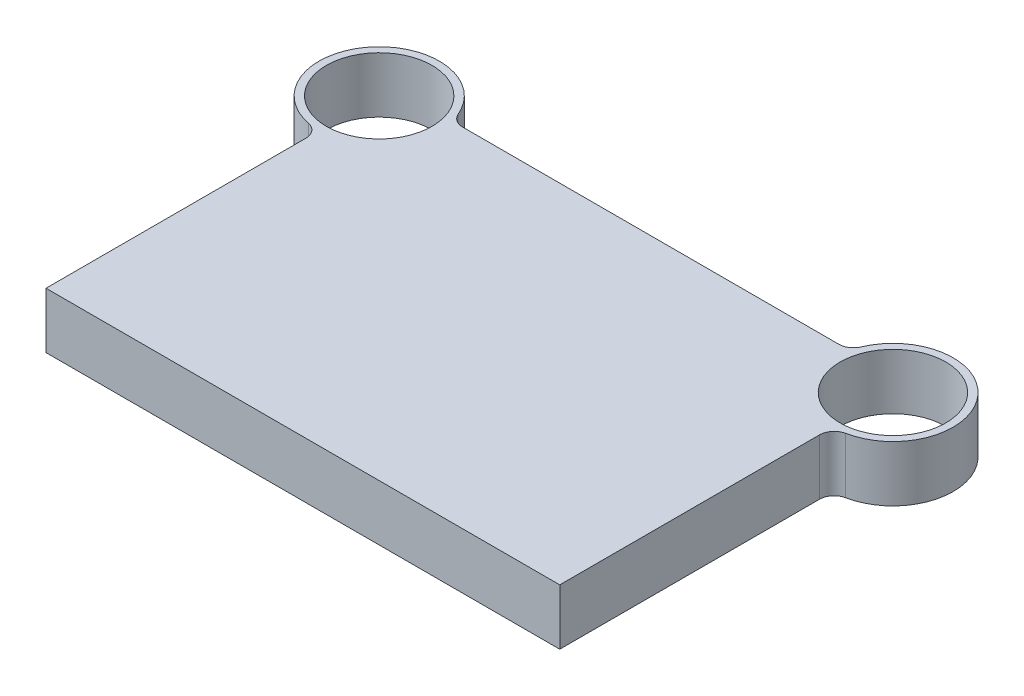
ISO-10303-21;
HEADER;
FILE_DESCRIPTION(('STEP AP214'),'2;1');
FILE_NAME('part.step','',(''),(''),'','','');
FILE_SCHEMA(('AUTOMOTIVE_DESIGN { 1 0 10303 214 1 1 1 1 }'));
ENDSEC;
DATA;
#1=APPLICATION_CONTEXT('core data for automotive mechanical design processes');
#2=APPLICATION_PROTOCOL_DEFINITION('international standard','automotive_design',2000,#1);
#3=PRODUCT_CONTEXT('',#1,'mechanical');
#4=PRODUCT('Part','Part','',(#3));
#5=PRODUCT_RELATED_PRODUCT_CATEGORY('part','',(#4));
#6=PRODUCT_DEFINITION_FORMATION('','',#4);
#7=PRODUCT_DEFINITION_CONTEXT('part definition',#1,'design');
#8=PRODUCT_DEFINITION('design','',#6,#7);
#9=PRODUCT_DEFINITION_SHAPE('','',#8);
#10=(LENGTH_UNIT() NAMED_UNIT(*) SI_UNIT(.MILLI.,.METRE.));
#11=(NAMED_UNIT(*) PLANE_ANGLE_UNIT() SI_UNIT($,.RADIAN.));
#12=(NAMED_UNIT(*) SI_UNIT($,.STERADIAN.) SOLID_ANGLE_UNIT());
#13=UNCERTAINTY_MEASURE_WITH_UNIT(LENGTH_MEASURE(1.E-05),#10,'distance_accuracy_value','');
#14=(GEOMETRIC_REPRESENTATION_CONTEXT(3) GLOBAL_UNCERTAINTY_ASSIGNED_CONTEXT((#13)) GLOBAL_UNIT_ASSIGNED_CONTEXT((#10,
#11,#12)) REPRESENTATION_CONTEXT('',''));
#15=CARTESIAN_POINT('',(0.,0.,0.));
#16=DIRECTION('',(0.,0.,1.));
#17=DIRECTION('',(1.,0.,0.));
#18=AXIS2_PLACEMENT_3D('',#15,#16,#17);
#19=CARTESIAN_POINT('',(-175.,38.,-227.));
#20=DIRECTION('',(0.,1.,0.));
#21=DIRECTION('',(0.,0.,1.));
#22=AXIS2_PLACEMENT_3D('',#19,#20,#21);
#23=PLANE('',#22);
#24=CARTESIAN_POINT('',(-175.,38.,-227.));
#25=DIRECTION('',(0.,1.,0.));
#26=DIRECTION('',(0.,0.,1.));
#27=AXIS2_PLACEMENT_3D('',#24,#25,#26);
#28=CIRCLE('',#27,36.);
#29=CARTESIAN_POINT('',(-175.,38.,-191.));
#30=VERTEX_POINT('',#29);
#31=EDGE_CURVE('E240',#30,#30,#28,.T.);
#32=ORIENTED_EDGE('',*,*,#31,.F.);
#33=EDGE_LOOP('',(#32));
#34=FACE_BOUND('',#33,.T.);
#35=CARTESIAN_POINT('',(-175.,38.,-227.));
#36=DIRECTION('',(0.,1.,0.));
#37=DIRECTION('',(0.,0.,1.));
#38=AXIS2_PLACEMENT_3D('',#35,#36,#37);
#39=CIRCLE('',#38,41.);
#40=CARTESIAN_POINT('',(-137.284167189385,38.,-243.078431372549));
#41=VERTEX_POINT('',#40);
#42=CARTESIAN_POINT('',(-183.039215686275,38.,-186.795883156702));
#43=VERTEX_POINT('',#42);
#44=EDGE_CURVE('E133',#41,#43,#39,.T.);
#45=ORIENTED_EDGE('',*,*,#44,.T.);
#46=CARTESIAN_POINT('',(-185.,38.,-176.9900009998));
#47=DIRECTION('',(0.,1.,0.));
#48=DIRECTION('',(0.,0.,1.));
#49=AXIS2_PLACEMENT_3D('',#46,#47,#48);
#50=CIRCLE('',#49,10.);
#51=CARTESIAN_POINT('',(-175.,38.,-176.9900009998));
#52=VERTEX_POINT('',#51);
#53=EDGE_CURVE('E11',#43,#52,#50,.F.);
#54=ORIENTED_EDGE('',*,*,#53,.T.);
#55=DIRECTION('',(0.,0.,1.));
#56=VECTOR('',#55,1.);
#57=CARTESIAN_POINT('',(-175.,38.,0.));
#58=LINE('',#57,#56);
#59=CARTESIAN_POINT('',(-175.,38.,0.));
#60=VERTEX_POINT('',#59);
#61=EDGE_CURVE('E106',#52,#60,#58,.T.);
#62=ORIENTED_EDGE('',*,*,#61,.T.);
#63=DIRECTION('',(1.,0.,0.));
#64=VECTOR('',#63,1.);
#65=CARTESIAN_POINT('',(175.,38.,0.));
#66=LINE('',#65,#64);
#67=CARTESIAN_POINT('',(175.,38.,0.));
#68=VERTEX_POINT('',#67);
#69=EDGE_CURVE('E110',#60,#68,#66,.T.);
#70=ORIENTED_EDGE('',*,*,#69,.T.);
#71=DIRECTION('',(0.,0.,-1.));
#72=VECTOR('',#71,1.);
#73=CARTESIAN_POINT('',(175.,38.,0.));
#74=LINE('',#73,#72);
#75=CARTESIAN_POINT('',(175.,38.,-176.9900009998));
#76=VERTEX_POINT('',#75);
#77=EDGE_CURVE('E123',#68,#76,#74,.T.);
#78=ORIENTED_EDGE('',*,*,#77,.T.);
#79=CARTESIAN_POINT('',(185.,38.,-176.9900009998));
#80=DIRECTION('',(0.,1.,0.));
#81=DIRECTION('',(0.,0.,1.));
#82=AXIS2_PLACEMENT_3D('',#79,#80,#81);
#83=CIRCLE('',#82,10.);
#84=CARTESIAN_POINT('',(183.039215686275,38.,-186.795883156702));
#85=VERTEX_POINT('',#84);
#86=EDGE_CURVE('E155',#76,#85,#83,.F.);
#87=ORIENTED_EDGE('',*,*,#86,.T.);
#88=CARTESIAN_POINT('',(175.,38.,-227.));
#89=DIRECTION('',(0.,1.,0.));
#90=DIRECTION('',(0.,0.,-1.));
#91=AXIS2_PLACEMENT_3D('',#88,#89,#90);
#92=CIRCLE('',#91,41.);
#93=CARTESIAN_POINT('',(137.284167189385,38.,-243.078431372549));
#94=VERTEX_POINT('',#93);
#95=EDGE_CURVE('E229',#85,#94,#92,.T.);
#96=ORIENTED_EDGE('',*,*,#95,.T.);
#97=CARTESIAN_POINT('',(128.08518357704,38.,-247.));
#98=DIRECTION('',(0.,1.,0.));
#99=DIRECTION('',(0.,0.,1.));
#100=AXIS2_PLACEMENT_3D('',#97,#98,#99);
#101=CIRCLE('',#100,10.);
#102=CARTESIAN_POINT('',(128.08518357704,38.,-237.));
#103=VERTEX_POINT('',#102);
#104=EDGE_CURVE('E159',#94,#103,#101,.F.);
#105=ORIENTED_EDGE('',*,*,#104,.T.);
#106=DIRECTION('',(-1.,0.,0.));
#107=VECTOR('',#106,1.);
#108=CARTESIAN_POINT('',(135.238209295858,38.,-237.));
#109=LINE('',#108,#107);
#110=CARTESIAN_POINT('',(-128.08518357704,38.,-237.));
#111=VERTEX_POINT('',#110);
#112=EDGE_CURVE('E226',#103,#111,#109,.T.);
#113=ORIENTED_EDGE('',*,*,#112,.T.);
#114=CARTESIAN_POINT('',(-128.08518357704,38.,-247.));
#115=DIRECTION('',(0.,1.,0.));
#116=DIRECTION('',(0.,0.,1.));
#117=AXIS2_PLACEMENT_3D('',#114,#115,#116);
#118=CIRCLE('',#117,10.);
#119=EDGE_CURVE('E163',#111,#41,#118,.F.);
#120=ORIENTED_EDGE('',*,*,#119,.T.);
#121=EDGE_LOOP('',(#45,#54,#62,#70,#78,#87,#96,#105,#113,#120));
#122=FACE_BOUND('',#121,.T.);
#123=CARTESIAN_POINT('',(175.,38.,-227.));
#124=DIRECTION('',(0.,1.,0.));
#125=DIRECTION('',(0.,0.,-1.));
#126=AXIS2_PLACEMENT_3D('',#123,#124,#125);
#127=CIRCLE('',#126,36.);
#128=CARTESIAN_POINT('',(175.,38.,-263.));
#129=VERTEX_POINT('',#128);
#130=EDGE_CURVE('E257',#129,#129,#127,.T.);
#131=ORIENTED_EDGE('',*,*,#130,.F.);
#132=EDGE_LOOP('',(#131));
#133=FACE_BOUND('',#132,.T.);
#134=ADVANCED_FACE('F33',(#34,#122,#133),#23,.T.);
#135=CARTESIAN_POINT('',(-175.,0.,-227.));
#136=DIRECTION('',(0.,1.,0.));
#137=DIRECTION('',(0.,0.,1.));
#138=AXIS2_PLACEMENT_3D('',#135,#136,#137);
#139=PLANE('',#138);
#140=DIRECTION('',(0.,0.,1.));
#141=VECTOR('',#140,1.);
#142=CARTESIAN_POINT('',(-175.,0.,0.));
#143=LINE('',#142,#141);
#144=CARTESIAN_POINT('',(-175.,0.,-176.9900009998));
#145=VERTEX_POINT('',#144);
#146=CARTESIAN_POINT('',(-175.,0.,0.));
#147=VERTEX_POINT('',#146);
#148=EDGE_CURVE('E127',#145,#147,#143,.T.);
#149=ORIENTED_EDGE('',*,*,#148,.F.);
#150=CARTESIAN_POINT('',(-185.,0.,-176.9900009998));
#151=DIRECTION('',(0.,1.,0.));
#152=DIRECTION('',(0.,0.,1.));
#153=AXIS2_PLACEMENT_3D('',#150,#151,#152);
#154=CIRCLE('',#153,10.);
#155=CARTESIAN_POINT('',(-183.039215686275,0.,-186.795883156702));
#156=VERTEX_POINT('',#155);
#157=EDGE_CURVE('E41',#145,#156,#154,.T.);
#158=ORIENTED_EDGE('',*,*,#157,.T.);
#159=CARTESIAN_POINT('',(-175.,0.,-227.));
#160=DIRECTION('',(0.,1.,0.));
#161=DIRECTION('',(0.,0.,1.));
#162=AXIS2_PLACEMENT_3D('',#159,#160,#161);
#163=CIRCLE('',#162,41.);
#164=CARTESIAN_POINT('',(-137.284167189385,0.,-243.078431372549));
#165=VERTEX_POINT('',#164);
#166=EDGE_CURVE('E114',#165,#156,#163,.T.);
#167=ORIENTED_EDGE('',*,*,#166,.F.);
#168=CARTESIAN_POINT('',(-128.08518357704,0.,-247.));
#169=DIRECTION('',(0.,1.,0.));
#170=DIRECTION('',(0.,0.,1.));
#171=AXIS2_PLACEMENT_3D('',#168,#169,#170);
#172=CIRCLE('',#171,10.);
#173=CARTESIAN_POINT('',(-128.08518357704,0.,-237.));
#174=VERTEX_POINT('',#173);
#175=EDGE_CURVE('E161',#165,#174,#172,.T.);
#176=ORIENTED_EDGE('',*,*,#175,.T.);
#177=DIRECTION('',(-1.,0.,0.));
#178=VECTOR('',#177,1.);
#179=CARTESIAN_POINT('',(135.238209295858,0.,-237.));
#180=LINE('',#179,#178);
#181=CARTESIAN_POINT('',(128.08518357704,0.,-237.));
#182=VERTEX_POINT('',#181);
#183=EDGE_CURVE('E173',#182,#174,#180,.T.);
#184=ORIENTED_EDGE('',*,*,#183,.F.);
#185=CARTESIAN_POINT('',(128.08518357704,0.,-247.));
#186=DIRECTION('',(0.,1.,0.));
#187=DIRECTION('',(0.,0.,1.));
#188=AXIS2_PLACEMENT_3D('',#185,#186,#187);
#189=CIRCLE('',#188,10.);
#190=CARTESIAN_POINT('',(137.284167189385,0.,-243.078431372549));
#191=VERTEX_POINT('',#190);
#192=EDGE_CURVE('E157',#182,#191,#189,.T.);
#193=ORIENTED_EDGE('',*,*,#192,.T.);
#194=CARTESIAN_POINT('',(175.,0.,-227.));
#195=DIRECTION('',(0.,1.,0.));
#196=DIRECTION('',(0.,0.,-1.));
#197=AXIS2_PLACEMENT_3D('',#194,#195,#196);
#198=CIRCLE('',#197,41.);
#199=CARTESIAN_POINT('',(183.039215686275,0.,-186.795883156702));
#200=VERTEX_POINT('',#199);
#201=EDGE_CURVE('E245',#200,#191,#198,.T.);
#202=ORIENTED_EDGE('',*,*,#201,.F.);
#203=CARTESIAN_POINT('',(185.,0.,-176.9900009998));
#204=DIRECTION('',(0.,1.,0.));
#205=DIRECTION('',(0.,0.,1.));
#206=AXIS2_PLACEMENT_3D('',#203,#204,#205);
#207=CIRCLE('',#206,10.);
#208=CARTESIAN_POINT('',(175.,0.,-176.9900009998));
#209=VERTEX_POINT('',#208);
#210=EDGE_CURVE('E153',#200,#209,#207,.T.);
#211=ORIENTED_EDGE('',*,*,#210,.T.);
#212=DIRECTION('',(0.,0.,-1.));
#213=VECTOR('',#212,1.);
#214=CARTESIAN_POINT('',(175.,0.,0.));
#215=LINE('',#214,#213);
#216=CARTESIAN_POINT('',(175.,0.,0.));
#217=VERTEX_POINT('',#216);
#218=EDGE_CURVE('E242',#217,#209,#215,.T.);
#219=ORIENTED_EDGE('',*,*,#218,.F.);
#220=DIRECTION('',(1.,0.,0.));
#221=VECTOR('',#220,1.);
#222=CARTESIAN_POINT('',(175.,0.,0.));
#223=LINE('',#222,#221);
#224=EDGE_CURVE('E239',#147,#217,#223,.T.);
#225=ORIENTED_EDGE('',*,*,#224,.F.);
#226=EDGE_LOOP('',(#149,#158,#167,#176,#184,#193,#202,#211,#219,#225));
#227=FACE_BOUND('',#226,.T.);
#228=CARTESIAN_POINT('',(-175.,0.,-227.));
#229=DIRECTION('',(0.,1.,0.));
#230=DIRECTION('',(0.,0.,1.));
#231=AXIS2_PLACEMENT_3D('',#228,#229,#230);
#232=CIRCLE('',#231,36.);
#233=CARTESIAN_POINT('',(-175.,0.,-191.));
#234=VERTEX_POINT('',#233);
#235=EDGE_CURVE('E254',#234,#234,#232,.T.);
#236=ORIENTED_EDGE('',*,*,#235,.T.);
#237=EDGE_LOOP('',(#236));
#238=FACE_BOUND('',#237,.T.);
#239=CARTESIAN_POINT('',(175.,0.,-227.));
#240=DIRECTION('',(0.,1.,0.));
#241=DIRECTION('',(0.,0.,-1.));
#242=AXIS2_PLACEMENT_3D('',#239,#240,#241);
#243=CIRCLE('',#242,36.);
#244=CARTESIAN_POINT('',(175.,0.,-263.));
#245=VERTEX_POINT('',#244);
#246=EDGE_CURVE('E260',#245,#245,#243,.T.);
#247=ORIENTED_EDGE('',*,*,#246,.T.);
#248=EDGE_LOOP('',(#247));
#249=FACE_BOUND('',#248,.T.);
#250=ADVANCED_FACE('F167',(#227,#238,#249),#139,.F.);
#251=CARTESIAN_POINT('',(-175.,38.,0.));
#252=DIRECTION('',(1.,0.,0.));
#253=DIRECTION('',(0.,0.,-1.));
#254=AXIS2_PLACEMENT_3D('',#251,#252,#253);
#255=PLANE('',#254);
#256=ORIENTED_EDGE('',*,*,#61,.F.);
#257=DIRECTION('',(0.,1.,0.));
#258=VECTOR('',#257,1.);
#259=CARTESIAN_POINT('',(-175.,0.,-176.9900009998));
#260=LINE('',#259,#258);
#261=EDGE_CURVE('E151',#52,#145,#260,.F.);
#262=ORIENTED_EDGE('',*,*,#261,.T.);
#263=ORIENTED_EDGE('',*,*,#148,.T.);
#264=DIRECTION('',(0.,-1.,0.));
#265=VECTOR('',#264,1.);
#266=CARTESIAN_POINT('',(-175.,38.,0.));
#267=LINE('',#266,#265);
#268=EDGE_CURVE('E119',#60,#147,#267,.T.);
#269=ORIENTED_EDGE('',*,*,#268,.F.);
#270=EDGE_LOOP('',(#256,#262,#263,#269));
#271=FACE_BOUND('',#270,.T.);
#272=ADVANCED_FACE('F125',(#271),#255,.F.);
#273=CARTESIAN_POINT('',(175.,38.,0.));
#274=DIRECTION('',(0.,0.,-1.));
#275=DIRECTION('',(-1.,0.,0.));
#276=AXIS2_PLACEMENT_3D('',#273,#274,#275);
#277=PLANE('',#276);
#278=ORIENTED_EDGE('',*,*,#224,.T.);
#279=DIRECTION('',(0.,-1.,0.));
#280=VECTOR('',#279,1.);
#281=CARTESIAN_POINT('',(175.,38.,0.));
#282=LINE('',#281,#280);
#283=EDGE_CURVE('E121',#68,#217,#282,.T.);
#284=ORIENTED_EDGE('',*,*,#283,.F.);
#285=ORIENTED_EDGE('',*,*,#69,.F.);
#286=ORIENTED_EDGE('',*,*,#268,.T.);
#287=EDGE_LOOP('',(#278,#284,#285,#286));
#288=FACE_BOUND('',#287,.T.);
#289=ADVANCED_FACE('F118',(#288),#277,.F.);
#290=CARTESIAN_POINT('',(175.,38.,0.));
#291=DIRECTION('',(-1.,0.,0.));
#292=DIRECTION('',(0.,0.,1.));
#293=AXIS2_PLACEMENT_3D('',#290,#291,#292);
#294=PLANE('',#293);
#295=ORIENTED_EDGE('',*,*,#218,.T.);
#296=DIRECTION('',(0.,1.,0.));
#297=VECTOR('',#296,1.);
#298=CARTESIAN_POINT('',(175.,38.,-176.9900009998));
#299=LINE('',#298,#297);
#300=EDGE_CURVE('E139',#209,#76,#299,.T.);
#301=ORIENTED_EDGE('',*,*,#300,.T.);
#302=ORIENTED_EDGE('',*,*,#77,.F.);
#303=ORIENTED_EDGE('',*,*,#283,.T.);
#304=EDGE_LOOP('',(#295,#301,#302,#303));
#305=FACE_BOUND('',#304,.T.);
#306=ADVANCED_FACE('F202',(#305),#294,.F.);
#307=CARTESIAN_POINT('',(175.,38.,-227.));
#308=DIRECTION('',(0.,-1.,0.));
#309=DIRECTION('',(0.,0.,-1.));
#310=AXIS2_PLACEMENT_3D('',#307,#308,#309);
#311=CYLINDRICAL_SURFACE('',#310,41.);
#312=ORIENTED_EDGE('',*,*,#95,.F.);
#313=DIRECTION('',(0.,-1.,0.));
#314=VECTOR('',#313,1.);
#315=CARTESIAN_POINT('',(183.039215686275,38.,-186.795883156702));
#316=LINE('',#315,#314);
#317=EDGE_CURVE('E131',#85,#200,#316,.T.);
#318=ORIENTED_EDGE('',*,*,#317,.T.);
#319=ORIENTED_EDGE('',*,*,#201,.T.);
#320=DIRECTION('',(0.,-1.,0.));
#321=VECTOR('',#320,1.);
#322=CARTESIAN_POINT('',(137.284167189385,38.,-243.078431372549));
#323=LINE('',#322,#321);
#324=EDGE_CURVE('E129',#191,#94,#323,.F.);
#325=ORIENTED_EDGE('',*,*,#324,.T.);
#326=EDGE_LOOP('',(#312,#318,#319,#325));
#327=FACE_BOUND('',#326,.T.);
#328=ADVANCED_FACE('F198',(#327),#311,.T.);
#329=CARTESIAN_POINT('',(135.238209295858,38.,-237.));
#330=DIRECTION('',(0.,0.,1.));
#331=DIRECTION('',(1.,0.,0.));
#332=AXIS2_PLACEMENT_3D('',#329,#330,#331);
#333=PLANE('',#332);
#334=ORIENTED_EDGE('',*,*,#112,.F.);
#335=DIRECTION('',(0.,1.,0.));
#336=VECTOR('',#335,1.);
#337=CARTESIAN_POINT('',(128.08518357704,0.,-237.));
#338=LINE('',#337,#336);
#339=EDGE_CURVE('E143',#103,#182,#338,.F.);
#340=ORIENTED_EDGE('',*,*,#339,.T.);
#341=ORIENTED_EDGE('',*,*,#183,.T.);
#342=DIRECTION('',(0.,1.,0.));
#343=VECTOR('',#342,1.);
#344=CARTESIAN_POINT('',(-128.08518357704,38.,-237.));
#345=LINE('',#344,#343);
#346=EDGE_CURVE('E141',#174,#111,#345,.T.);
#347=ORIENTED_EDGE('',*,*,#346,.T.);
#348=EDGE_LOOP('',(#334,#340,#341,#347));
#349=FACE_BOUND('',#348,.T.);
#350=ADVANCED_FACE('F195',(#349),#333,.F.);
#351=CARTESIAN_POINT('',(-175.,38.,-227.));
#352=DIRECTION('',(0.,-1.,0.));
#353=DIRECTION('',(0.,0.,-1.));
#354=AXIS2_PLACEMENT_3D('',#351,#352,#353);
#355=CYLINDRICAL_SURFACE('',#354,41.);
#356=ORIENTED_EDGE('',*,*,#44,.F.);
#357=DIRECTION('',(0.,-1.,0.));
#358=VECTOR('',#357,1.);
#359=CARTESIAN_POINT('',(-137.284167189385,38.,-243.078431372549));
#360=LINE('',#359,#358);
#361=EDGE_CURVE('E148',#41,#165,#360,.T.);
#362=ORIENTED_EDGE('',*,*,#361,.T.);
#363=ORIENTED_EDGE('',*,*,#166,.T.);
#364=DIRECTION('',(0.,-1.,0.));
#365=VECTOR('',#364,1.);
#366=CARTESIAN_POINT('',(-183.039215686275,38.,-186.795883156702));
#367=LINE('',#366,#365);
#368=EDGE_CURVE('E146',#156,#43,#367,.F.);
#369=ORIENTED_EDGE('',*,*,#368,.T.);
#370=EDGE_LOOP('',(#356,#362,#363,#369));
#371=FACE_BOUND('',#370,.T.);
#372=ADVANCED_FACE('F171',(#371),#355,.T.);
#373=CARTESIAN_POINT('',(-175.,38.,-227.));
#374=DIRECTION('',(0.,-1.,0.));
#375=DIRECTION('',(0.,0.,-1.));
#376=AXIS2_PLACEMENT_3D('',#373,#374,#375);
#377=CYLINDRICAL_SURFACE('',#376,36.);
#378=ORIENTED_EDGE('',*,*,#31,.T.);
#379=EDGE_LOOP('',(#378));
#380=FACE_BOUND('',#379,.T.);
#381=ORIENTED_EDGE('',*,*,#235,.F.);
#382=EDGE_LOOP('',(#381));
#383=FACE_BOUND('',#382,.T.);
#384=ADVANCED_FACE('F190',(#380,#383),#377,.F.);
#385=CARTESIAN_POINT('',(175.,38.,-227.));
#386=DIRECTION('',(0.,-1.,0.));
#387=DIRECTION('',(0.,0.,-1.));
#388=AXIS2_PLACEMENT_3D('',#385,#386,#387);
#389=CYLINDRICAL_SURFACE('',#388,36.);
#390=ORIENTED_EDGE('',*,*,#130,.T.);
#391=EDGE_LOOP('',(#390));
#392=FACE_BOUND('',#391,.T.);
#393=ORIENTED_EDGE('',*,*,#246,.F.);
#394=EDGE_LOOP('',(#393));
#395=FACE_BOUND('',#394,.T.);
#396=ADVANCED_FACE('F214',(#392,#395),#389,.F.);
#397=CARTESIAN_POINT('',(185.,38.,-176.9900009998));
#398=DIRECTION('',(0.,-1.,0.));
#399=DIRECTION('',(0.,0.,-1.));
#400=AXIS2_PLACEMENT_3D('',#397,#398,#399);
#401=CYLINDRICAL_SURFACE('',#400,10.);
#402=ORIENTED_EDGE('',*,*,#86,.F.);
#403=ORIENTED_EDGE('',*,*,#300,.F.);
#404=ORIENTED_EDGE('',*,*,#210,.F.);
#405=ORIENTED_EDGE('',*,*,#317,.F.);
#406=EDGE_LOOP('',(#402,#403,#404,#405));
#407=FACE_BOUND('',#406,.T.);
#408=ADVANCED_FACE('F211',(#407),#401,.F.);
#409=CARTESIAN_POINT('',(128.08518357704,38.,-247.));
#410=DIRECTION('',(0.,-1.,0.));
#411=DIRECTION('',(0.,0.,-1.));
#412=AXIS2_PLACEMENT_3D('',#409,#410,#411);
#413=CYLINDRICAL_SURFACE('',#412,10.);
#414=ORIENTED_EDGE('',*,*,#104,.F.);
#415=ORIENTED_EDGE('',*,*,#324,.F.);
#416=ORIENTED_EDGE('',*,*,#192,.F.);
#417=ORIENTED_EDGE('',*,*,#339,.F.);
#418=EDGE_LOOP('',(#414,#415,#416,#417));
#419=FACE_BOUND('',#418,.T.);
#420=ADVANCED_FACE('F179',(#419),#413,.F.);
#421=CARTESIAN_POINT('',(-128.08518357704,38.,-247.));
#422=DIRECTION('',(0.,-1.,0.));
#423=DIRECTION('',(0.,0.,-1.));
#424=AXIS2_PLACEMENT_3D('',#421,#422,#423);
#425=CYLINDRICAL_SURFACE('',#424,10.);
#426=ORIENTED_EDGE('',*,*,#119,.F.);
#427=ORIENTED_EDGE('',*,*,#346,.F.);
#428=ORIENTED_EDGE('',*,*,#175,.F.);
#429=ORIENTED_EDGE('',*,*,#361,.F.);
#430=EDGE_LOOP('',(#426,#427,#428,#429));
#431=FACE_BOUND('',#430,.T.);
#432=ADVANCED_FACE('F175',(#431),#425,.F.);
#433=CARTESIAN_POINT('',(-185.,38.,-176.9900009998));
#434=DIRECTION('',(0.,-1.,0.));
#435=DIRECTION('',(0.,0.,-1.));
#436=AXIS2_PLACEMENT_3D('',#433,#434,#435);
#437=CYLINDRICAL_SURFACE('',#436,10.);
#438=ORIENTED_EDGE('',*,*,#53,.F.);
#439=ORIENTED_EDGE('',*,*,#368,.F.);
#440=ORIENTED_EDGE('',*,*,#157,.F.);
#441=ORIENTED_EDGE('',*,*,#261,.F.);
#442=EDGE_LOOP('',(#438,#439,#440,#441));
#443=FACE_BOUND('',#442,.T.);
#444=ADVANCED_FACE('F35',(#443),#437,.F.);
#445=CLOSED_SHELL('',(#134,#250,#272,#289,#306,#328,#350,#372,#384,#396,#408,#420,#432,#444));
#446=MANIFOLD_SOLID_BREP('B2',#445);
#447=ADVANCED_BREP_SHAPE_REPRESENTATION('',(#18,#446),#14);
#448=SHAPE_DEFINITION_REPRESENTATION(#9,#447);
ENDSEC;
END-ISO-10303-21;
